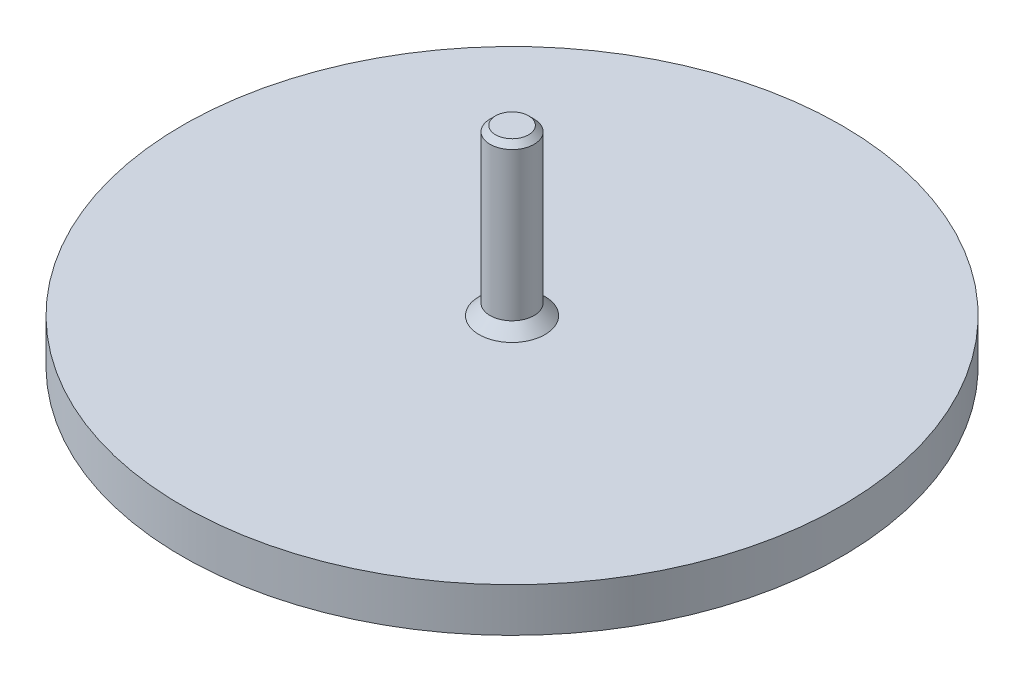
ISO-10303-21;
HEADER;
FILE_DESCRIPTION(('STEP AP214'),'2;1');
FILE_NAME('part.step','',(''),(''),'','','');
FILE_SCHEMA(('AUTOMOTIVE_DESIGN { 1 0 10303 214 1 1 1 1 }'));
ENDSEC;
DATA;
#1=APPLICATION_CONTEXT('core data for automotive mechanical design processes');
#2=APPLICATION_PROTOCOL_DEFINITION('international standard','automotive_design',2000,#1);
#3=PRODUCT_CONTEXT('',#1,'mechanical');
#4=PRODUCT('Part','Part','',(#3));
#5=PRODUCT_RELATED_PRODUCT_CATEGORY('part','',(#4));
#6=PRODUCT_DEFINITION_FORMATION('','',#4);
#7=PRODUCT_DEFINITION_CONTEXT('part definition',#1,'design');
#8=PRODUCT_DEFINITION('design','',#6,#7);
#9=PRODUCT_DEFINITION_SHAPE('','',#8);
#10=(LENGTH_UNIT() NAMED_UNIT(*) SI_UNIT(.MILLI.,.METRE.));
#11=(NAMED_UNIT(*) PLANE_ANGLE_UNIT() SI_UNIT($,.RADIAN.));
#12=(NAMED_UNIT(*) SI_UNIT($,.STERADIAN.) SOLID_ANGLE_UNIT());
#13=UNCERTAINTY_MEASURE_WITH_UNIT(LENGTH_MEASURE(1.E-05),#10,'distance_accuracy_value','');
#14=(GEOMETRIC_REPRESENTATION_CONTEXT(3) GLOBAL_UNCERTAINTY_ASSIGNED_CONTEXT((#13)) GLOBAL_UNIT_ASSIGNED_CONTEXT((#10,
#11,#12)) REPRESENTATION_CONTEXT('',''));
#15=CARTESIAN_POINT('',(0.,0.,0.));
#16=DIRECTION('',(0.,0.,1.));
#17=DIRECTION('',(1.,0.,0.));
#18=AXIS2_PLACEMENT_3D('',#15,#16,#17);
#19=CARTESIAN_POINT('',(0.,0.,0.));
#20=DIRECTION('',(0.,1.,0.));
#21=DIRECTION('',(0.,0.,1.));
#22=AXIS2_PLACEMENT_3D('',#19,#20,#21);
#23=PLANE('',#22);
#24=CARTESIAN_POINT('',(0.,0.,0.));
#25=DIRECTION('',(0.,-1.,0.));
#26=DIRECTION('',(0.,0.,-1.));
#27=AXIS2_PLACEMENT_3D('',#24,#25,#26);
#28=CIRCLE('',#27,30.);
#29=CARTESIAN_POINT('',(0.,0.,-30.));
#30=VERTEX_POINT('',#29);
#31=EDGE_CURVE('E49',#30,#30,#28,.T.);
#32=ORIENTED_EDGE('',*,*,#31,.T.);
#33=EDGE_LOOP('',(#32));
#34=FACE_BOUND('',#33,.T.);
#35=ADVANCED_FACE('F29',(#34),#23,.F.);
#36=CARTESIAN_POINT('',(0.,0.,0.));
#37=DIRECTION('',(0.,-1.,0.));
#38=DIRECTION('',(0.,0.,-1.));
#39=AXIS2_PLACEMENT_3D('',#36,#37,#38);
#40=CYLINDRICAL_SURFACE('',#39,30.);
#41=ORIENTED_EDGE('',*,*,#31,.F.);
#42=EDGE_LOOP('',(#41));
#43=FACE_BOUND('',#42,.T.);
#44=CARTESIAN_POINT('',(0.,4.,0.));
#45=DIRECTION('',(0.,-1.,0.));
#46=DIRECTION('',(0.,0.,-1.));
#47=AXIS2_PLACEMENT_3D('',#44,#45,#46);
#48=CIRCLE('',#47,30.);
#49=CARTESIAN_POINT('',(0.,4.,-30.));
#50=VERTEX_POINT('',#49);
#51=EDGE_CURVE('E52',#50,#50,#48,.T.);
#52=ORIENTED_EDGE('',*,*,#51,.T.);
#53=EDGE_LOOP('',(#52));
#54=FACE_BOUND('',#53,.T.);
#55=ADVANCED_FACE('F56',(#43,#54),#40,.T.);
#56=CARTESIAN_POINT('',(-30.,4.,0.));
#57=DIRECTION('',(0.,-1.,0.));
#58=DIRECTION('',(0.,0.,-1.));
#59=AXIS2_PLACEMENT_3D('',#56,#57,#58);
#60=PLANE('',#59);
#61=CARTESIAN_POINT('',(0.,4.,0.));
#62=DIRECTION('',(0.,-1.,0.));
#63=DIRECTION('',(0.,0.,-1.));
#64=AXIS2_PLACEMENT_3D('',#61,#62,#63);
#65=CIRCLE('',#64,2.99999999999998);
#66=CARTESIAN_POINT('',(0.,4.,-2.99999999999998));
#67=VERTEX_POINT('',#66);
#68=EDGE_CURVE('E44',#67,#67,#65,.T.);
#69=ORIENTED_EDGE('',*,*,#68,.T.);
#70=EDGE_LOOP('',(#69));
#71=FACE_BOUND('',#70,.T.);
#72=ORIENTED_EDGE('',*,*,#51,.F.);
#73=EDGE_LOOP('',(#72));
#74=FACE_BOUND('',#73,.T.);
#75=ADVANCED_FACE('F58',(#71,#74),#60,.F.);
#76=CARTESIAN_POINT('',(0.,0.,0.));
#77=DIRECTION('',(0.,-1.,0.));
#78=DIRECTION('',(0.,0.,-1.));
#79=AXIS2_PLACEMENT_3D('',#76,#77,#78);
#80=CYLINDRICAL_SURFACE('',#79,2.);
#81=CARTESIAN_POINT('',(0.,18.5,0.));
#82=DIRECTION('',(0.,-1.,0.));
#83=DIRECTION('',(0.,0.,-1.));
#84=AXIS2_PLACEMENT_3D('',#81,#82,#83);
#85=CIRCLE('',#84,2.);
#86=CARTESIAN_POINT('',(0.,18.5,-2.));
#87=VERTEX_POINT('',#86);
#88=EDGE_CURVE('E36',#87,#87,#85,.T.);
#89=ORIENTED_EDGE('',*,*,#88,.T.);
#90=EDGE_LOOP('',(#89));
#91=FACE_BOUND('',#90,.T.);
#92=CARTESIAN_POINT('',(0.,4.99999999999996,0.));
#93=DIRECTION('',(0.,-1.,0.));
#94=DIRECTION('',(0.,0.,-1.));
#95=AXIS2_PLACEMENT_3D('',#92,#93,#94);
#96=CIRCLE('',#95,2.);
#97=CARTESIAN_POINT('',(0.,4.99999999999996,-2.));
#98=VERTEX_POINT('',#97);
#99=EDGE_CURVE('E40',#98,#98,#96,.F.);
#100=ORIENTED_EDGE('',*,*,#99,.T.);
#101=EDGE_LOOP('',(#100));
#102=FACE_BOUND('',#101,.T.);
#103=ADVANCED_FACE('F60',(#91,#102),#80,.T.);
#104=CARTESIAN_POINT('',(-2.,19.,0.));
#105=DIRECTION('',(0.,-1.,0.));
#106=DIRECTION('',(0.,0.,-1.));
#107=AXIS2_PLACEMENT_3D('',#104,#105,#106);
#108=PLANE('',#107);
#109=CARTESIAN_POINT('',(0.,19.,0.));
#110=DIRECTION('',(0.,-1.,0.));
#111=DIRECTION('',(0.,0.,-1.));
#112=AXIS2_PLACEMENT_3D('',#109,#110,#111);
#113=CIRCLE('',#112,1.49999999999999);
#114=CARTESIAN_POINT('',(0.,19.,-1.49999999999999));
#115=VERTEX_POINT('',#114);
#116=EDGE_CURVE('E10',#115,#115,#113,.F.);
#117=ORIENTED_EDGE('',*,*,#116,.T.);
#118=EDGE_LOOP('',(#117));
#119=FACE_BOUND('',#118,.T.);
#120=ADVANCED_FACE('F67',(#119),#108,.F.);
#121=CARTESIAN_POINT('',(0.,4.,0.));
#122=DIRECTION('',(0.,-1.,0.));
#123=DIRECTION('',(0.,0.,-1.));
#124=AXIS2_PLACEMENT_3D('',#121,#122,#123);
#125=CONICAL_SURFACE('',#124,2.99999999999998,0.785398163397455);
#126=ORIENTED_EDGE('',*,*,#99,.F.);
#127=EDGE_LOOP('',(#126));
#128=FACE_BOUND('',#127,.T.);
#129=ORIENTED_EDGE('',*,*,#68,.F.);
#130=EDGE_LOOP('',(#129));
#131=FACE_BOUND('',#130,.T.);
#132=ADVANCED_FACE('F76',(#128,#131),#125,.T.);
#133=CARTESIAN_POINT('',(0.,18.5,0.));
#134=DIRECTION('',(0.,-1.,0.));
#135=DIRECTION('',(0.,0.,-1.));
#136=AXIS2_PLACEMENT_3D('',#133,#134,#135);
#137=CONICAL_SURFACE('',#136,2.,0.785398163397447);
#138=ORIENTED_EDGE('',*,*,#116,.F.);
#139=EDGE_LOOP('',(#138));
#140=FACE_BOUND('',#139,.T.);
#141=ORIENTED_EDGE('',*,*,#88,.F.);
#142=EDGE_LOOP('',(#141));
#143=FACE_BOUND('',#142,.T.);
#144=ADVANCED_FACE('F31',(#140,#143),#137,.T.);
#145=CLOSED_SHELL('',(#35,#55,#75,#103,#120,#132,#144));
#146=MANIFOLD_SOLID_BREP('B2',#145);
#147=ADVANCED_BREP_SHAPE_REPRESENTATION('',(#18,#146),#14);
#148=SHAPE_DEFINITION_REPRESENTATION(#9,#147);
ENDSEC;
END-ISO-10303-21;
